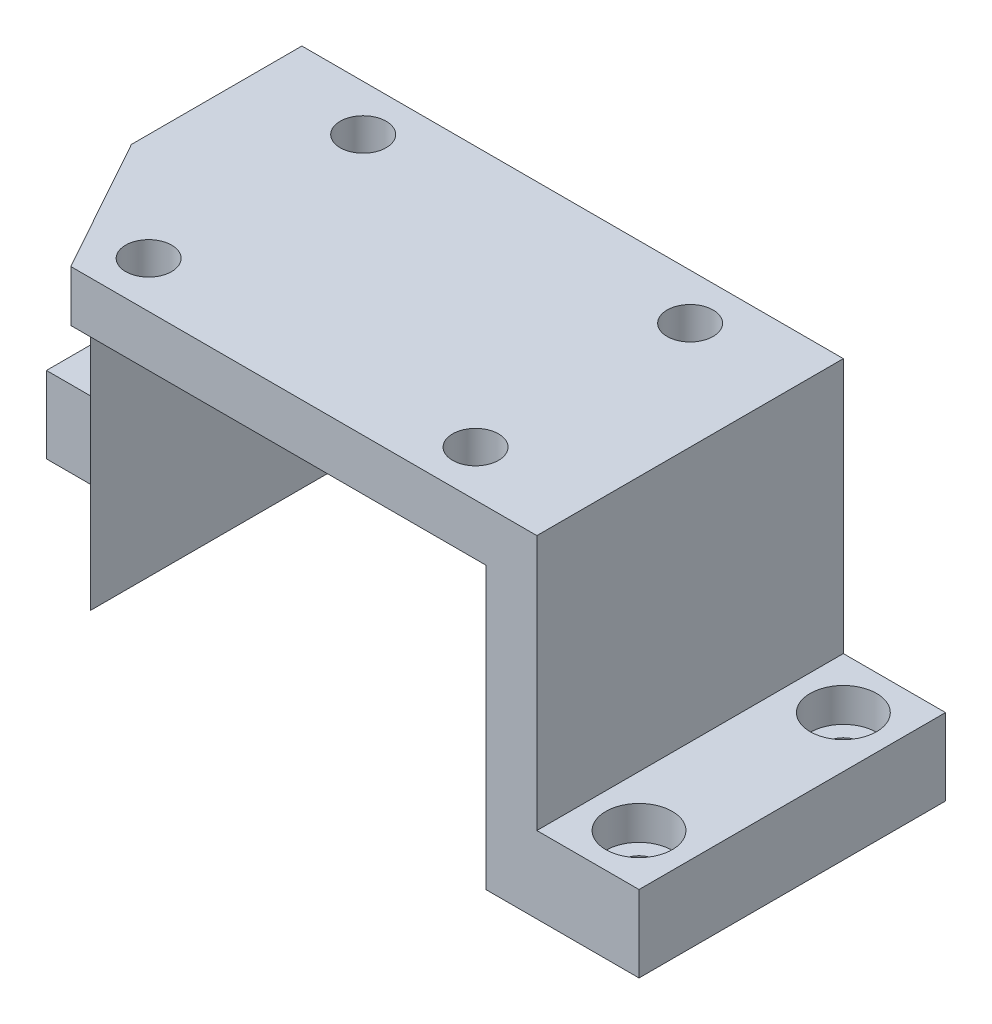
ISO-10303-21;
HEADER;
FILE_DESCRIPTION(('STEP AP214'),'2;1');
FILE_NAME('part.step','',(''),(''),'','','');
FILE_SCHEMA(('AUTOMOTIVE_DESIGN { 1 0 10303 214 1 1 1 1 }'));
ENDSEC;
DATA;
#1=APPLICATION_CONTEXT('core data for automotive mechanical design processes');
#2=APPLICATION_PROTOCOL_DEFINITION('international standard','automotive_design',2000,#1);
#3=PRODUCT_CONTEXT('',#1,'mechanical');
#4=PRODUCT('Part','Part','',(#3));
#5=PRODUCT_RELATED_PRODUCT_CATEGORY('part','',(#4));
#6=PRODUCT_DEFINITION_FORMATION('','',#4);
#7=PRODUCT_DEFINITION_CONTEXT('part definition',#1,'design');
#8=PRODUCT_DEFINITION('design','',#6,#7);
#9=PRODUCT_DEFINITION_SHAPE('','',#8);
#10=(LENGTH_UNIT() NAMED_UNIT(*) SI_UNIT(.MILLI.,.METRE.));
#11=(NAMED_UNIT(*) PLANE_ANGLE_UNIT() SI_UNIT($,.RADIAN.));
#12=(NAMED_UNIT(*) SI_UNIT($,.STERADIAN.) SOLID_ANGLE_UNIT());
#13=UNCERTAINTY_MEASURE_WITH_UNIT(LENGTH_MEASURE(1.E-05),#10,'distance_accuracy_value','');
#14=(GEOMETRIC_REPRESENTATION_CONTEXT(3) GLOBAL_UNCERTAINTY_ASSIGNED_CONTEXT((#13)) GLOBAL_UNIT_ASSIGNED_CONTEXT((#10,
#11,#12)) REPRESENTATION_CONTEXT('',''));
#15=CARTESIAN_POINT('',(0.,0.,0.));
#16=DIRECTION('',(0.,0.,1.));
#17=DIRECTION('',(1.,0.,0.));
#18=AXIS2_PLACEMENT_3D('',#15,#16,#17);
#19=CARTESIAN_POINT('',(-53.,10.,30.));
#20=DIRECTION('',(1.,0.,0.));
#21=DIRECTION('',(0.,0.,-1.));
#22=AXIS2_PLACEMENT_3D('',#19,#20,#21);
#23=PLANE('',#22);
#24=DIRECTION('',(0.,0.,-1.));
#25=VECTOR('',#24,1.);
#26=CARTESIAN_POINT('',(-53.,-55.,30.));
#27=LINE('',#26,#25);
#28=CARTESIAN_POINT('',(-53.,-55.,3.37045108443876));
#29=VERTEX_POINT('',#28);
#30=CARTESIAN_POINT('',(-53.,-55.,0.));
#31=VERTEX_POINT('',#30);
#32=EDGE_CURVE('E55',#29,#31,#27,.T.);
#33=ORIENTED_EDGE('',*,*,#32,.F.);
#34=DIRECTION('',(0.,1.,0.));
#35=VECTOR('',#34,1.);
#36=CARTESIAN_POINT('',(-53.,-55.,3.37045108443878));
#37=LINE('',#36,#35);
#38=CARTESIAN_POINT('',(-53.,10.,3.37045108443878));
#39=VERTEX_POINT('',#38);
#40=EDGE_CURVE('E48',#29,#39,#37,.T.);
#41=ORIENTED_EDGE('',*,*,#40,.T.);
#42=DIRECTION('',(0.,0.,1.));
#43=VECTOR('',#42,1.);
#44=CARTESIAN_POINT('',(-53.,10.,30.));
#45=LINE('',#44,#43);
#46=CARTESIAN_POINT('',(-53.,10.,-30.));
#47=VERTEX_POINT('',#46);
#48=EDGE_CURVE('E150',#47,#39,#45,.T.);
#49=ORIENTED_EDGE('',*,*,#48,.F.);
#50=DIRECTION('',(0.,-1.,0.));
#51=VECTOR('',#50,1.);
#52=CARTESIAN_POINT('',(-53.,10.,-30.));
#53=LINE('',#52,#51);
#54=CARTESIAN_POINT('',(-53.,-40.,-30.));
#55=VERTEX_POINT('',#54);
#56=EDGE_CURVE('E157',#47,#55,#53,.T.);
#57=ORIENTED_EDGE('',*,*,#56,.T.);
#58=DIRECTION('',(0.,0.,-1.));
#59=VECTOR('',#58,1.);
#60=CARTESIAN_POINT('',(-53.,-40.,-30.));
#61=LINE('',#60,#59);
#62=CARTESIAN_POINT('',(-53.,-40.,0.));
#63=VERTEX_POINT('',#62);
#64=EDGE_CURVE('E293',#63,#55,#61,.T.);
#65=ORIENTED_EDGE('',*,*,#64,.F.);
#66=DIRECTION('',(0.,1.,0.));
#67=VECTOR('',#66,1.);
#68=CARTESIAN_POINT('',(-53.,-40.,0.));
#69=LINE('',#68,#67);
#70=EDGE_CURVE('E288',#31,#63,#69,.T.);
#71=ORIENTED_EDGE('',*,*,#70,.F.);
#72=EDGE_LOOP('',(#33,#41,#49,#57,#65,#71));
#73=FACE_BOUND('',#72,.T.);
#74=ADVANCED_FACE('F34',(#73),#23,.F.);
#75=CARTESIAN_POINT('',(53.,10.,30.));
#76=DIRECTION('',(-1.,0.,0.));
#77=DIRECTION('',(0.,0.,1.));
#78=AXIS2_PLACEMENT_3D('',#75,#76,#77);
#79=PLANE('',#78);
#80=DIRECTION('',(0.,0.,1.));
#81=VECTOR('',#80,1.);
#82=CARTESIAN_POINT('',(53.,-40.,30.));
#83=LINE('',#82,#81);
#84=CARTESIAN_POINT('',(53.,-40.,-30.));
#85=VERTEX_POINT('',#84);
#86=CARTESIAN_POINT('',(53.,-40.,30.));
#87=VERTEX_POINT('',#86);
#88=EDGE_CURVE('E184',#85,#87,#83,.T.);
#89=ORIENTED_EDGE('',*,*,#88,.F.);
#90=DIRECTION('',(0.,-1.,0.));
#91=VECTOR('',#90,1.);
#92=CARTESIAN_POINT('',(53.,10.,-30.));
#93=LINE('',#92,#91);
#94=CARTESIAN_POINT('',(53.,10.,-30.));
#95=VERTEX_POINT('',#94);
#96=EDGE_CURVE('E42',#95,#85,#93,.T.);
#97=ORIENTED_EDGE('',*,*,#96,.F.);
#98=DIRECTION('',(0.,0.,-1.));
#99=VECTOR('',#98,1.);
#100=CARTESIAN_POINT('',(53.,10.,30.));
#101=LINE('',#100,#99);
#102=CARTESIAN_POINT('',(53.,10.,30.));
#103=VERTEX_POINT('',#102);
#104=EDGE_CURVE('E167',#103,#95,#101,.T.);
#105=ORIENTED_EDGE('',*,*,#104,.F.);
#106=DIRECTION('',(0.,-1.,0.));
#107=VECTOR('',#106,1.);
#108=CARTESIAN_POINT('',(53.,10.,30.));
#109=LINE('',#108,#107);
#110=EDGE_CURVE('E154',#103,#87,#109,.T.);
#111=ORIENTED_EDGE('',*,*,#110,.T.);
#112=EDGE_LOOP('',(#89,#97,#105,#111));
#113=FACE_BOUND('',#112,.T.);
#114=ADVANCED_FACE('F36',(#113),#79,.F.);
#115=CARTESIAN_POINT('',(0.,0.,0.));
#116=DIRECTION('',(0.,-1.,0.));
#117=DIRECTION('',(0.,0.,-1.));
#118=AXIS2_PLACEMENT_3D('',#115,#116,#117);
#119=PLANE('',#118);
#120=DIRECTION('',(0.484809620246341,0.,0.874619707139394));
#121=VECTOR('',#120,1.);
#122=CARTESIAN_POINT('',(-41.9720128148531,0.,23.2654666109649));
#123=LINE('',#122,#121);
#124=CARTESIAN_POINT('',(-43.,0.,21.4109286371528));
#125=VERTEX_POINT('',#124);
#126=CARTESIAN_POINT('',(-38.239,0.,30.));
#127=VERTEX_POINT('',#126);
#128=EDGE_CURVE('E138',#125,#127,#123,.T.);
#129=ORIENTED_EDGE('',*,*,#128,.F.);
#130=DIRECTION('',(0.,0.,1.));
#131=VECTOR('',#130,1.);
#132=CARTESIAN_POINT('',(-43.,0.,30.));
#133=LINE('',#132,#131);
#134=CARTESIAN_POINT('',(-43.,0.,-30.));
#135=VERTEX_POINT('',#134);
#136=EDGE_CURVE('E205',#135,#125,#133,.T.);
#137=ORIENTED_EDGE('',*,*,#136,.F.);
#138=DIRECTION('',(-1.,0.,0.));
#139=VECTOR('',#138,1.);
#140=CARTESIAN_POINT('',(-53.,0.,-30.));
#141=LINE('',#140,#139);
#142=CARTESIAN_POINT('',(43.,0.,-30.));
#143=VERTEX_POINT('',#142);
#144=EDGE_CURVE('E163',#143,#135,#141,.T.);
#145=ORIENTED_EDGE('',*,*,#144,.F.);
#146=DIRECTION('',(0.,0.,-1.));
#147=VECTOR('',#146,1.);
#148=CARTESIAN_POINT('',(43.,0.,30.));
#149=LINE('',#148,#147);
#150=CARTESIAN_POINT('',(43.,0.,30.));
#151=VERTEX_POINT('',#150);
#152=EDGE_CURVE('E186',#151,#143,#149,.T.);
#153=ORIENTED_EDGE('',*,*,#152,.F.);
#154=DIRECTION('',(1.,0.,0.));
#155=VECTOR('',#154,1.);
#156=CARTESIAN_POINT('',(-53.,0.,30.));
#157=LINE('',#156,#155);
#158=EDGE_CURVE('E165',#127,#151,#157,.T.);
#159=ORIENTED_EDGE('',*,*,#158,.F.);
#160=EDGE_LOOP('',(#129,#137,#145,#153,#159));
#161=FACE_BOUND('',#160,.T.);
#162=CARTESIAN_POINT('',(-32.,0.,21.));
#163=DIRECTION('',(0.,-1.,0.));
#164=DIRECTION('',(0.,0.,-1.));
#165=AXIS2_PLACEMENT_3D('',#162,#163,#164);
#166=CIRCLE('',#165,4.5);
#167=CARTESIAN_POINT('',(-32.,0.,16.5));
#168=VERTEX_POINT('',#167);
#169=EDGE_CURVE('E285',#168,#168,#166,.T.);
#170=ORIENTED_EDGE('',*,*,#169,.F.);
#171=EDGE_LOOP('',(#170));
#172=FACE_BOUND('',#171,.T.);
#173=CARTESIAN_POINT('',(32.,0.,21.));
#174=DIRECTION('',(0.,-1.,0.));
#175=DIRECTION('',(0.,0.,-1.));
#176=AXIS2_PLACEMENT_3D('',#173,#174,#175);
#177=CIRCLE('',#176,4.5);
#178=CARTESIAN_POINT('',(32.,0.,16.5));
#179=VERTEX_POINT('',#178);
#180=EDGE_CURVE('E282',#179,#179,#177,.T.);
#181=ORIENTED_EDGE('',*,*,#180,.F.);
#182=EDGE_LOOP('',(#181));
#183=FACE_BOUND('',#182,.T.);
#184=CARTESIAN_POINT('',(32.,0.,-21.));
#185=DIRECTION('',(0.,-1.,0.));
#186=DIRECTION('',(0.,0.,-1.));
#187=AXIS2_PLACEMENT_3D('',#184,#185,#186);
#188=CIRCLE('',#187,4.5);
#189=CARTESIAN_POINT('',(32.,0.,-25.5));
#190=VERTEX_POINT('',#189);
#191=EDGE_CURVE('E279',#190,#190,#188,.T.);
#192=ORIENTED_EDGE('',*,*,#191,.F.);
#193=EDGE_LOOP('',(#192));
#194=FACE_BOUND('',#193,.T.);
#195=CARTESIAN_POINT('',(-32.,0.,-21.));
#196=DIRECTION('',(0.,-1.,0.));
#197=DIRECTION('',(0.,0.,-1.));
#198=AXIS2_PLACEMENT_3D('',#195,#196,#197);
#199=CIRCLE('',#198,4.5);
#200=CARTESIAN_POINT('',(-32.,0.,-25.5));
#201=VERTEX_POINT('',#200);
#202=EDGE_CURVE('E276',#201,#201,#199,.T.);
#203=ORIENTED_EDGE('',*,*,#202,.F.);
#204=EDGE_LOOP('',(#203));
#205=FACE_BOUND('',#204,.T.);
#206=ADVANCED_FACE('F334',(#161,#172,#183,#194,#205),#119,.T.);
#207=CARTESIAN_POINT('',(-53.,10.,-30.));
#208=DIRECTION('',(0.,0.,1.));
#209=DIRECTION('',(1.,0.,0.));
#210=AXIS2_PLACEMENT_3D('',#207,#208,#209);
#211=PLANE('',#210);
#212=ORIENTED_EDGE('',*,*,#96,.T.);
#213=DIRECTION('',(-1.,0.,0.));
#214=VECTOR('',#213,1.);
#215=CARTESIAN_POINT('',(73.,-40.,-30.));
#216=LINE('',#215,#214);
#217=CARTESIAN_POINT('',(73.,-40.,-30.));
#218=VERTEX_POINT('',#217);
#219=EDGE_CURVE('E176',#218,#85,#216,.T.);
#220=ORIENTED_EDGE('',*,*,#219,.F.);
#221=DIRECTION('',(0.,1.,0.));
#222=VECTOR('',#221,1.);
#223=CARTESIAN_POINT('',(73.,-55.,-30.));
#224=LINE('',#223,#222);
#225=CARTESIAN_POINT('',(73.,-55.,-30.));
#226=VERTEX_POINT('',#225);
#227=EDGE_CURVE('E315',#226,#218,#224,.T.);
#228=ORIENTED_EDGE('',*,*,#227,.F.);
#229=DIRECTION('',(1.,0.,0.));
#230=VECTOR('',#229,1.);
#231=CARTESIAN_POINT('',(53.,-55.,-30.));
#232=LINE('',#231,#230);
#233=CARTESIAN_POINT('',(43.,-55.,-30.));
#234=VERTEX_POINT('',#233);
#235=EDGE_CURVE('E198',#234,#226,#232,.T.);
#236=ORIENTED_EDGE('',*,*,#235,.F.);
#237=DIRECTION('',(0.,1.,0.));
#238=VECTOR('',#237,1.);
#239=CARTESIAN_POINT('',(43.,-55.,-30.));
#240=LINE('',#239,#238);
#241=EDGE_CURVE('E199',#234,#143,#240,.T.);
#242=ORIENTED_EDGE('',*,*,#241,.T.);
#243=ORIENTED_EDGE('',*,*,#144,.T.);
#244=DIRECTION('',(0.,1.,0.));
#245=VECTOR('',#244,1.);
#246=CARTESIAN_POINT('',(-43.,-55.,-30.));
#247=LINE('',#246,#245);
#248=CARTESIAN_POINT('',(-43.,-55.,-30.));
#249=VERTEX_POINT('',#248);
#250=EDGE_CURVE('E166',#249,#135,#247,.T.);
#251=ORIENTED_EDGE('',*,*,#250,.F.);
#252=DIRECTION('',(1.,0.,0.));
#253=VECTOR('',#252,1.);
#254=CARTESIAN_POINT('',(-53.,-55.,-30.));
#255=LINE('',#254,#253);
#256=CARTESIAN_POINT('',(-73.,-55.,-30.));
#257=VERTEX_POINT('',#256);
#258=EDGE_CURVE('E207',#257,#249,#255,.T.);
#259=ORIENTED_EDGE('',*,*,#258,.F.);
#260=DIRECTION('',(0.,-1.,0.));
#261=VECTOR('',#260,1.);
#262=CARTESIAN_POINT('',(-73.,-55.,-30.));
#263=LINE('',#262,#261);
#264=CARTESIAN_POINT('',(-73.,-40.,-30.));
#265=VERTEX_POINT('',#264);
#266=EDGE_CURVE('E289',#265,#257,#263,.T.);
#267=ORIENTED_EDGE('',*,*,#266,.F.);
#268=DIRECTION('',(1.,0.,0.));
#269=VECTOR('',#268,1.);
#270=CARTESIAN_POINT('',(-73.,-40.,-30.));
#271=LINE('',#270,#269);
#272=EDGE_CURVE('E219',#265,#55,#271,.T.);
#273=ORIENTED_EDGE('',*,*,#272,.T.);
#274=ORIENTED_EDGE('',*,*,#56,.F.);
#275=DIRECTION('',(-1.,0.,0.));
#276=VECTOR('',#275,1.);
#277=CARTESIAN_POINT('',(-53.,10.,-30.));
#278=LINE('',#277,#276);
#279=EDGE_CURVE('E159',#95,#47,#278,.T.);
#280=ORIENTED_EDGE('',*,*,#279,.F.);
#281=EDGE_LOOP('',(#212,#220,#228,#236,#242,#243,#251,#259,#267,#273,#274,#280));
#282=FACE_BOUND('',#281,.T.);
#283=ADVANCED_FACE('F174',(#282),#211,.F.);
#284=CARTESIAN_POINT('',(-53.,10.,30.));
#285=DIRECTION('',(0.,0.,-1.));
#286=DIRECTION('',(-1.,0.,0.));
#287=AXIS2_PLACEMENT_3D('',#284,#285,#286);
#288=PLANE('',#287);
#289=DIRECTION('',(1.,0.,0.));
#290=VECTOR('',#289,1.);
#291=CARTESIAN_POINT('',(-53.,10.,30.));
#292=LINE('',#291,#290);
#293=CARTESIAN_POINT('',(-38.239,10.,30.));
#294=VERTEX_POINT('',#293);
#295=EDGE_CURVE('E147',#294,#103,#292,.T.);
#296=ORIENTED_EDGE('',*,*,#295,.F.);
#297=DIRECTION('',(0.,1.,0.));
#298=VECTOR('',#297,1.);
#299=CARTESIAN_POINT('',(-38.239,-55.,30.));
#300=LINE('',#299,#298);
#301=EDGE_CURVE('E133',#127,#294,#300,.T.);
#302=ORIENTED_EDGE('',*,*,#301,.F.);
#303=ORIENTED_EDGE('',*,*,#158,.T.);
#304=DIRECTION('',(0.,1.,0.));
#305=VECTOR('',#304,1.);
#306=CARTESIAN_POINT('',(43.,-55.,30.));
#307=LINE('',#306,#305);
#308=CARTESIAN_POINT('',(43.,-55.,30.));
#309=VERTEX_POINT('',#308);
#310=EDGE_CURVE('E202',#309,#151,#307,.T.);
#311=ORIENTED_EDGE('',*,*,#310,.F.);
#312=DIRECTION('',(-1.,0.,0.));
#313=VECTOR('',#312,1.);
#314=CARTESIAN_POINT('',(53.,-55.,30.));
#315=LINE('',#314,#313);
#316=CARTESIAN_POINT('',(73.,-55.,30.));
#317=VERTEX_POINT('',#316);
#318=EDGE_CURVE('E190',#317,#309,#315,.T.);
#319=ORIENTED_EDGE('',*,*,#318,.F.);
#320=DIRECTION('',(0.,-1.,0.));
#321=VECTOR('',#320,1.);
#322=CARTESIAN_POINT('',(73.,-55.,30.));
#323=LINE('',#322,#321);
#324=CARTESIAN_POINT('',(73.,-40.,30.));
#325=VERTEX_POINT('',#324);
#326=EDGE_CURVE('E309',#325,#317,#323,.T.);
#327=ORIENTED_EDGE('',*,*,#326,.F.);
#328=DIRECTION('',(-1.,0.,0.));
#329=VECTOR('',#328,1.);
#330=CARTESIAN_POINT('',(73.,-40.,30.));
#331=LINE('',#330,#329);
#332=EDGE_CURVE('E187',#325,#87,#331,.T.);
#333=ORIENTED_EDGE('',*,*,#332,.T.);
#334=ORIENTED_EDGE('',*,*,#110,.F.);
#335=EDGE_LOOP('',(#296,#302,#303,#311,#319,#327,#333,#334));
#336=FACE_BOUND('',#335,.T.);
#337=ADVANCED_FACE('F152',(#336),#288,.F.);
#338=CARTESIAN_POINT('',(0.,10.,0.));
#339=DIRECTION('',(0.,-1.,0.));
#340=DIRECTION('',(0.,0.,-1.));
#341=AXIS2_PLACEMENT_3D('',#338,#339,#340);
#342=PLANE('',#341);
#343=CARTESIAN_POINT('',(-32.,10.,21.));
#344=DIRECTION('',(0.,1.,0.));
#345=DIRECTION('',(0.,0.,-1.));
#346=AXIS2_PLACEMENT_3D('',#343,#344,#345);
#347=CIRCLE('',#346,4.5);
#348=CARTESIAN_POINT('',(-32.,10.,16.5));
#349=VERTEX_POINT('',#348);
#350=EDGE_CURVE('E262',#349,#349,#347,.T.);
#351=ORIENTED_EDGE('',*,*,#350,.F.);
#352=EDGE_LOOP('',(#351));
#353=FACE_BOUND('',#352,.T.);
#354=CARTESIAN_POINT('',(32.,10.,21.));
#355=DIRECTION('',(0.,1.,0.));
#356=DIRECTION('',(0.,0.,1.));
#357=AXIS2_PLACEMENT_3D('',#354,#355,#356);
#358=CIRCLE('',#357,4.5);
#359=CARTESIAN_POINT('',(32.,10.,25.5));
#360=VERTEX_POINT('',#359);
#361=EDGE_CURVE('E269',#360,#360,#358,.T.);
#362=ORIENTED_EDGE('',*,*,#361,.F.);
#363=EDGE_LOOP('',(#362));
#364=FACE_BOUND('',#363,.T.);
#365=CARTESIAN_POINT('',(32.,10.,-21.));
#366=DIRECTION('',(0.,1.,0.));
#367=DIRECTION('',(0.,0.,-1.));
#368=AXIS2_PLACEMENT_3D('',#365,#366,#367);
#369=CIRCLE('',#368,4.5);
#370=CARTESIAN_POINT('',(32.,10.,-25.5));
#371=VERTEX_POINT('',#370);
#372=EDGE_CURVE('E265',#371,#371,#369,.T.);
#373=ORIENTED_EDGE('',*,*,#372,.F.);
#374=EDGE_LOOP('',(#373));
#375=FACE_BOUND('',#374,.T.);
#376=CARTESIAN_POINT('',(-32.,10.,-21.));
#377=DIRECTION('',(0.,1.,0.));
#378=DIRECTION('',(0.,0.,1.));
#379=AXIS2_PLACEMENT_3D('',#376,#377,#378);
#380=CIRCLE('',#379,4.5);
#381=CARTESIAN_POINT('',(-32.,10.,-16.5));
#382=VERTEX_POINT('',#381);
#383=EDGE_CURVE('E268',#382,#382,#380,.T.);
#384=ORIENTED_EDGE('',*,*,#383,.F.);
#385=EDGE_LOOP('',(#384));
#386=FACE_BOUND('',#385,.T.);
#387=ORIENTED_EDGE('',*,*,#48,.T.);
#388=DIRECTION('',(-0.484809620246341,0.,-0.874619707139394));
#389=VECTOR('',#388,1.);
#390=CARTESIAN_POINT('',(-38.239,10.,30.));
#391=LINE('',#390,#389);
#392=EDGE_CURVE('E136',#294,#39,#391,.T.);
#393=ORIENTED_EDGE('',*,*,#392,.F.);
#394=ORIENTED_EDGE('',*,*,#295,.T.);
#395=ORIENTED_EDGE('',*,*,#104,.T.);
#396=ORIENTED_EDGE('',*,*,#279,.T.);
#397=EDGE_LOOP('',(#387,#393,#394,#395,#396));
#398=FACE_BOUND('',#397,.T.);
#399=ADVANCED_FACE('F145',(#353,#364,#375,#386,#398),#342,.F.);
#400=CARTESIAN_POINT('',(-43.,-55.,30.));
#401=DIRECTION('',(-1.,0.,0.));
#402=DIRECTION('',(0.,0.,1.));
#403=AXIS2_PLACEMENT_3D('',#400,#401,#402);
#404=PLANE('',#403);
#405=ORIENTED_EDGE('',*,*,#136,.T.);
#406=DIRECTION('',(0.,-1.,0.));
#407=VECTOR('',#406,1.);
#408=CARTESIAN_POINT('',(-43.,-55.,21.4109286371528));
#409=LINE('',#408,#407);
#410=CARTESIAN_POINT('',(-43.,-55.,21.4109286371528));
#411=VERTEX_POINT('',#410);
#412=EDGE_CURVE('E222',#125,#411,#409,.T.);
#413=ORIENTED_EDGE('',*,*,#412,.T.);
#414=DIRECTION('',(0.,0.,1.));
#415=VECTOR('',#414,1.);
#416=CARTESIAN_POINT('',(-43.,-55.,30.));
#417=LINE('',#416,#415);
#418=EDGE_CURVE('E209',#249,#411,#417,.T.);
#419=ORIENTED_EDGE('',*,*,#418,.F.);
#420=ORIENTED_EDGE('',*,*,#250,.T.);
#421=EDGE_LOOP('',(#405,#413,#419,#420));
#422=FACE_BOUND('',#421,.T.);
#423=ADVANCED_FACE('F338',(#422),#404,.F.);
#424=CARTESIAN_POINT('',(0.,-55.,0.));
#425=DIRECTION('',(0.,-1.,0.));
#426=DIRECTION('',(0.,0.,-1.));
#427=AXIS2_PLACEMENT_3D('',#424,#425,#426);
#428=PLANE('',#427);
#429=DIRECTION('',(0.484809620246341,0.,0.874619707139394));
#430=VECTOR('',#429,1.);
#431=CARTESIAN_POINT('',(-41.9720128148531,-55.,23.2654666109649));
#432=LINE('',#431,#430);
#433=EDGE_CURVE('E11',#29,#411,#432,.T.);
#434=ORIENTED_EDGE('',*,*,#433,.F.);
#435=ORIENTED_EDGE('',*,*,#32,.T.);
#436=DIRECTION('',(1.,0.,0.));
#437=VECTOR('',#436,1.);
#438=CARTESIAN_POINT('',(-73.,-55.,0.));
#439=LINE('',#438,#437);
#440=CARTESIAN_POINT('',(-73.,-55.,0.));
#441=VERTEX_POINT('',#440);
#442=EDGE_CURVE('E306',#441,#31,#439,.T.);
#443=ORIENTED_EDGE('',*,*,#442,.F.);
#444=DIRECTION('',(0.,0.,1.));
#445=VECTOR('',#444,1.);
#446=CARTESIAN_POINT('',(-73.,-55.,-30.));
#447=LINE('',#446,#445);
#448=EDGE_CURVE('E292',#257,#441,#447,.T.);
#449=ORIENTED_EDGE('',*,*,#448,.F.);
#450=ORIENTED_EDGE('',*,*,#258,.T.);
#451=ORIENTED_EDGE('',*,*,#418,.T.);
#452=EDGE_LOOP('',(#434,#435,#443,#449,#450,#451));
#453=FACE_BOUND('',#452,.T.);
#454=CARTESIAN_POINT('',(-63.,-55.,-20.));
#455=DIRECTION('',(0.,1.,0.));
#456=DIRECTION('',(0.,0.,1.));
#457=AXIS2_PLACEMENT_3D('',#454,#455,#456);
#458=CIRCLE('',#457,3.3);
#459=CARTESIAN_POINT('',(-63.,-55.,-16.7));
#460=VERTEX_POINT('',#459);
#461=EDGE_CURVE('E229',#460,#460,#458,.T.);
#462=ORIENTED_EDGE('',*,*,#461,.T.);
#463=EDGE_LOOP('',(#462));
#464=FACE_BOUND('',#463,.T.);
#465=ADVANCED_FACE('F340',(#453,#464),#428,.T.);
#466=CARTESIAN_POINT('',(43.,-55.,30.));
#467=DIRECTION('',(1.,0.,0.));
#468=DIRECTION('',(0.,0.,-1.));
#469=AXIS2_PLACEMENT_3D('',#466,#467,#468);
#470=PLANE('',#469);
#471=ORIENTED_EDGE('',*,*,#152,.T.);
#472=ORIENTED_EDGE('',*,*,#241,.F.);
#473=DIRECTION('',(0.,0.,-1.));
#474=VECTOR('',#473,1.);
#475=CARTESIAN_POINT('',(43.,-55.,30.));
#476=LINE('',#475,#474);
#477=EDGE_CURVE('E196',#309,#234,#476,.T.);
#478=ORIENTED_EDGE('',*,*,#477,.F.);
#479=ORIENTED_EDGE('',*,*,#310,.T.);
#480=EDGE_LOOP('',(#471,#472,#478,#479));
#481=FACE_BOUND('',#480,.T.);
#482=ADVANCED_FACE('F332',(#481),#470,.F.);
#483=CARTESIAN_POINT('',(0.,-55.,0.));
#484=DIRECTION('',(0.,1.,0.));
#485=DIRECTION('',(0.,0.,1.));
#486=AXIS2_PLACEMENT_3D('',#483,#484,#485);
#487=PLANE('',#486);
#488=CARTESIAN_POINT('',(63.,-55.,20.));
#489=DIRECTION('',(0.,1.,0.));
#490=DIRECTION('',(0.,0.,1.));
#491=AXIS2_PLACEMENT_3D('',#488,#489,#490);
#492=CIRCLE('',#491,3.29999999999999);
#493=CARTESIAN_POINT('',(63.,-55.,23.3));
#494=VERTEX_POINT('',#493);
#495=EDGE_CURVE('E236',#494,#494,#492,.T.);
#496=ORIENTED_EDGE('',*,*,#495,.T.);
#497=EDGE_LOOP('',(#496));
#498=FACE_BOUND('',#497,.T.);
#499=CARTESIAN_POINT('',(63.,-55.,-20.));
#500=DIRECTION('',(0.,1.,0.));
#501=DIRECTION('',(0.,0.,1.));
#502=AXIS2_PLACEMENT_3D('',#499,#500,#501);
#503=CIRCLE('',#502,3.29999999999999);
#504=CARTESIAN_POINT('',(63.,-55.,-16.7));
#505=VERTEX_POINT('',#504);
#506=EDGE_CURVE('E242',#505,#505,#503,.T.);
#507=ORIENTED_EDGE('',*,*,#506,.T.);
#508=EDGE_LOOP('',(#507));
#509=FACE_BOUND('',#508,.T.);
#510=ORIENTED_EDGE('',*,*,#235,.T.);
#511=DIRECTION('',(0.,0.,-1.));
#512=VECTOR('',#511,1.);
#513=CARTESIAN_POINT('',(73.,-55.,30.));
#514=LINE('',#513,#512);
#515=EDGE_CURVE('E312',#317,#226,#514,.T.);
#516=ORIENTED_EDGE('',*,*,#515,.F.);
#517=ORIENTED_EDGE('',*,*,#318,.T.);
#518=ORIENTED_EDGE('',*,*,#477,.T.);
#519=EDGE_LOOP('',(#510,#516,#517,#518));
#520=FACE_BOUND('',#519,.T.);
#521=ADVANCED_FACE('F324',(#498,#509,#520),#487,.F.);
#522=CARTESIAN_POINT('',(73.,-40.,30.));
#523=DIRECTION('',(0.,-1.,0.));
#524=DIRECTION('',(0.,0.,-1.));
#525=AXIS2_PLACEMENT_3D('',#522,#523,#524);
#526=PLANE('',#525);
#527=CARTESIAN_POINT('',(63.,-40.,20.));
#528=DIRECTION('',(0.,1.,0.));
#529=DIRECTION('',(0.,0.,1.));
#530=AXIS2_PLACEMENT_3D('',#527,#528,#529);
#531=CIRCLE('',#530,6.5);
#532=CARTESIAN_POINT('',(63.,-40.,26.5));
#533=VERTEX_POINT('',#532);
#534=EDGE_CURVE('E251',#533,#533,#531,.T.);
#535=ORIENTED_EDGE('',*,*,#534,.F.);
#536=EDGE_LOOP('',(#535));
#537=FACE_BOUND('',#536,.T.);
#538=CARTESIAN_POINT('',(63.,-40.,-20.));
#539=DIRECTION('',(0.,1.,0.));
#540=DIRECTION('',(0.,0.,1.));
#541=AXIS2_PLACEMENT_3D('',#538,#539,#540);
#542=CIRCLE('',#541,6.5);
#543=CARTESIAN_POINT('',(63.,-40.,-13.5));
#544=VERTEX_POINT('',#543);
#545=EDGE_CURVE('E250',#544,#544,#542,.T.);
#546=ORIENTED_EDGE('',*,*,#545,.F.);
#547=EDGE_LOOP('',(#546));
#548=FACE_BOUND('',#547,.T.);
#549=ORIENTED_EDGE('',*,*,#88,.T.);
#550=ORIENTED_EDGE('',*,*,#332,.F.);
#551=DIRECTION('',(0.,0.,1.));
#552=VECTOR('',#551,1.);
#553=CARTESIAN_POINT('',(73.,-40.,30.));
#554=LINE('',#553,#552);
#555=EDGE_CURVE('E185',#218,#325,#554,.T.);
#556=ORIENTED_EDGE('',*,*,#555,.F.);
#557=ORIENTED_EDGE('',*,*,#219,.T.);
#558=EDGE_LOOP('',(#549,#550,#556,#557));
#559=FACE_BOUND('',#558,.T.);
#560=ADVANCED_FACE('F182',(#537,#548,#559),#526,.F.);
#561=CARTESIAN_POINT('',(73.,0.,0.));
#562=DIRECTION('',(-1.,0.,0.));
#563=DIRECTION('',(0.,0.,1.));
#564=AXIS2_PLACEMENT_3D('',#561,#562,#563);
#565=PLANE('',#564);
#566=ORIENTED_EDGE('',*,*,#326,.T.);
#567=ORIENTED_EDGE('',*,*,#515,.T.);
#568=ORIENTED_EDGE('',*,*,#227,.T.);
#569=ORIENTED_EDGE('',*,*,#555,.T.);
#570=EDGE_LOOP('',(#566,#567,#568,#569));
#571=FACE_BOUND('',#570,.T.);
#572=ADVANCED_FACE('F318',(#571),#565,.F.);
#573=CARTESIAN_POINT('',(-73.,-40.,0.));
#574=DIRECTION('',(0.,0.,-1.));
#575=DIRECTION('',(-1.,0.,0.));
#576=AXIS2_PLACEMENT_3D('',#573,#574,#575);
#577=PLANE('',#576);
#578=ORIENTED_EDGE('',*,*,#70,.T.);
#579=DIRECTION('',(1.,0.,0.));
#580=VECTOR('',#579,1.);
#581=CARTESIAN_POINT('',(-73.,-40.,0.));
#582=LINE('',#581,#580);
#583=CARTESIAN_POINT('',(-73.,-40.,0.));
#584=VERTEX_POINT('',#583);
#585=EDGE_CURVE('E303',#584,#63,#582,.T.);
#586=ORIENTED_EDGE('',*,*,#585,.F.);
#587=DIRECTION('',(0.,1.,0.));
#588=VECTOR('',#587,1.);
#589=CARTESIAN_POINT('',(-73.,-40.,0.));
#590=LINE('',#589,#588);
#591=EDGE_CURVE('E295',#441,#584,#590,.T.);
#592=ORIENTED_EDGE('',*,*,#591,.F.);
#593=ORIENTED_EDGE('',*,*,#442,.T.);
#594=EDGE_LOOP('',(#578,#586,#592,#593));
#595=FACE_BOUND('',#594,.T.);
#596=ADVANCED_FACE('F350',(#595),#577,.F.);
#597=CARTESIAN_POINT('',(-73.,-40.,-30.));
#598=DIRECTION('',(0.,-1.,0.));
#599=DIRECTION('',(0.,0.,-1.));
#600=AXIS2_PLACEMENT_3D('',#597,#598,#599);
#601=PLANE('',#600);
#602=CARTESIAN_POINT('',(-63.,-40.,-20.));
#603=DIRECTION('',(0.,1.,0.));
#604=DIRECTION('',(0.,0.,1.));
#605=AXIS2_PLACEMENT_3D('',#602,#603,#604);
#606=CIRCLE('',#605,6.5);
#607=CARTESIAN_POINT('',(-63.,-40.,-13.5));
#608=VERTEX_POINT('',#607);
#609=EDGE_CURVE('E232',#608,#608,#606,.T.);
#610=ORIENTED_EDGE('',*,*,#609,.F.);
#611=EDGE_LOOP('',(#610));
#612=FACE_BOUND('',#611,.T.);
#613=ORIENTED_EDGE('',*,*,#64,.T.);
#614=ORIENTED_EDGE('',*,*,#272,.F.);
#615=DIRECTION('',(0.,0.,-1.));
#616=VECTOR('',#615,1.);
#617=CARTESIAN_POINT('',(-73.,-40.,-30.));
#618=LINE('',#617,#616);
#619=EDGE_CURVE('E297',#584,#265,#618,.T.);
#620=ORIENTED_EDGE('',*,*,#619,.F.);
#621=ORIENTED_EDGE('',*,*,#585,.T.);
#622=EDGE_LOOP('',(#613,#614,#620,#621));
#623=FACE_BOUND('',#622,.T.);
#624=ADVANCED_FACE('F348',(#612,#623),#601,.F.);
#625=CARTESIAN_POINT('',(-73.,0.,0.));
#626=DIRECTION('',(1.,0.,0.));
#627=DIRECTION('',(0.,0.,-1.));
#628=AXIS2_PLACEMENT_3D('',#625,#626,#627);
#629=PLANE('',#628);
#630=ORIENTED_EDGE('',*,*,#266,.T.);
#631=ORIENTED_EDGE('',*,*,#448,.T.);
#632=ORIENTED_EDGE('',*,*,#591,.T.);
#633=ORIENTED_EDGE('',*,*,#619,.T.);
#634=EDGE_LOOP('',(#630,#631,#632,#633));
#635=FACE_BOUND('',#634,.T.);
#636=ADVANCED_FACE('F344',(#635),#629,.F.);
#637=CARTESIAN_POINT('',(-32.,-55.,-21.));
#638=DIRECTION('',(0.,1.,0.));
#639=DIRECTION('',(0.,0.,1.));
#640=AXIS2_PLACEMENT_3D('',#637,#638,#639);
#641=CYLINDRICAL_SURFACE('',#640,4.5);
#642=ORIENTED_EDGE('',*,*,#202,.T.);
#643=EDGE_LOOP('',(#642));
#644=FACE_BOUND('',#643,.T.);
#645=ORIENTED_EDGE('',*,*,#383,.T.);
#646=EDGE_LOOP('',(#645));
#647=FACE_BOUND('',#646,.T.);
#648=ADVANCED_FACE('F418',(#644,#647),#641,.F.);
#649=CARTESIAN_POINT('',(32.,-55.,-21.));
#650=DIRECTION('',(0.,1.,0.));
#651=DIRECTION('',(0.,0.,1.));
#652=AXIS2_PLACEMENT_3D('',#649,#650,#651);
#653=CYLINDRICAL_SURFACE('',#652,4.5);
#654=ORIENTED_EDGE('',*,*,#191,.T.);
#655=EDGE_LOOP('',(#654));
#656=FACE_BOUND('',#655,.T.);
#657=ORIENTED_EDGE('',*,*,#372,.T.);
#658=EDGE_LOOP('',(#657));
#659=FACE_BOUND('',#658,.T.);
#660=ADVANCED_FACE('F414',(#656,#659),#653,.F.);
#661=CARTESIAN_POINT('',(32.,-55.,21.));
#662=DIRECTION('',(0.,1.,0.));
#663=DIRECTION('',(0.,0.,1.));
#664=AXIS2_PLACEMENT_3D('',#661,#662,#663);
#665=CYLINDRICAL_SURFACE('',#664,4.5);
#666=ORIENTED_EDGE('',*,*,#180,.T.);
#667=EDGE_LOOP('',(#666));
#668=FACE_BOUND('',#667,.T.);
#669=ORIENTED_EDGE('',*,*,#361,.T.);
#670=EDGE_LOOP('',(#669));
#671=FACE_BOUND('',#670,.T.);
#672=ADVANCED_FACE('F417',(#668,#671),#665,.F.);
#673=CARTESIAN_POINT('',(-32.,-55.,21.));
#674=DIRECTION('',(0.,1.,0.));
#675=DIRECTION('',(0.,0.,1.));
#676=AXIS2_PLACEMENT_3D('',#673,#674,#675);
#677=CYLINDRICAL_SURFACE('',#676,4.5);
#678=ORIENTED_EDGE('',*,*,#169,.T.);
#679=EDGE_LOOP('',(#678));
#680=FACE_BOUND('',#679,.T.);
#681=ORIENTED_EDGE('',*,*,#350,.T.);
#682=EDGE_LOOP('',(#681));
#683=FACE_BOUND('',#682,.T.);
#684=ADVANCED_FACE('F422',(#680,#683),#677,.F.);
#685=CARTESIAN_POINT('',(-63.,-46.6,-20.));
#686=DIRECTION('',(0.,1.,0.));
#687=DIRECTION('',(0.,0.,1.));
#688=AXIS2_PLACEMENT_3D('',#685,#686,#687);
#689=CYLINDRICAL_SURFACE('',#688,6.5);
#690=CARTESIAN_POINT('',(-63.,-46.6,-20.));
#691=DIRECTION('',(0.,1.,0.));
#692=DIRECTION('',(0.,0.,1.));
#693=AXIS2_PLACEMENT_3D('',#690,#691,#692);
#694=CIRCLE('',#693,6.5);
#695=CARTESIAN_POINT('',(-63.,-46.6,-13.5));
#696=VERTEX_POINT('',#695);
#697=EDGE_CURVE('E254',#696,#696,#694,.T.);
#698=ORIENTED_EDGE('',*,*,#697,.F.);
#699=EDGE_LOOP('',(#698));
#700=FACE_BOUND('',#699,.T.);
#701=ORIENTED_EDGE('',*,*,#609,.T.);
#702=EDGE_LOOP('',(#701));
#703=FACE_BOUND('',#702,.T.);
#704=ADVANCED_FACE('F408',(#700,#703),#689,.F.);
#705=CARTESIAN_POINT('',(-63.,-46.6,-20.));
#706=DIRECTION('',(0.,1.,0.));
#707=DIRECTION('',(0.,0.,1.));
#708=AXIS2_PLACEMENT_3D('',#705,#706,#707);
#709=PLANE('',#708);
#710=CARTESIAN_POINT('',(-63.,-46.6,-20.));
#711=DIRECTION('',(0.,1.,0.));
#712=DIRECTION('',(0.,0.,1.));
#713=AXIS2_PLACEMENT_3D('',#710,#711,#712);
#714=CIRCLE('',#713,3.3);
#715=CARTESIAN_POINT('',(-63.,-46.6,-16.7));
#716=VERTEX_POINT('',#715);
#717=EDGE_CURVE('E233',#716,#716,#714,.T.);
#718=ORIENTED_EDGE('',*,*,#717,.F.);
#719=EDGE_LOOP('',(#718));
#720=FACE_BOUND('',#719,.T.);
#721=ORIENTED_EDGE('',*,*,#697,.T.);
#722=EDGE_LOOP('',(#721));
#723=FACE_BOUND('',#722,.T.);
#724=ADVANCED_FACE('F398',(#720,#723),#709,.T.);
#725=CARTESIAN_POINT('',(63.,-46.6,-20.));
#726=DIRECTION('',(0.,1.,0.));
#727=DIRECTION('',(0.,0.,1.));
#728=AXIS2_PLACEMENT_3D('',#725,#726,#727);
#729=CYLINDRICAL_SURFACE('',#728,6.5);
#730=CARTESIAN_POINT('',(63.,-46.6,-20.));
#731=DIRECTION('',(0.,1.,0.));
#732=DIRECTION('',(0.,0.,1.));
#733=AXIS2_PLACEMENT_3D('',#730,#731,#732);
#734=CIRCLE('',#733,6.5);
#735=CARTESIAN_POINT('',(63.,-46.6,-13.5));
#736=VERTEX_POINT('',#735);
#737=EDGE_CURVE('E259',#736,#736,#734,.T.);
#738=ORIENTED_EDGE('',*,*,#737,.F.);
#739=EDGE_LOOP('',(#738));
#740=FACE_BOUND('',#739,.T.);
#741=ORIENTED_EDGE('',*,*,#545,.T.);
#742=EDGE_LOOP('',(#741));
#743=FACE_BOUND('',#742,.T.);
#744=ADVANCED_FACE('F395',(#740,#743),#729,.F.);
#745=CARTESIAN_POINT('',(63.,-46.6,-20.));
#746=DIRECTION('',(0.,1.,0.));
#747=DIRECTION('',(0.,0.,1.));
#748=AXIS2_PLACEMENT_3D('',#745,#746,#747);
#749=PLANE('',#748);
#750=CARTESIAN_POINT('',(63.,-46.6,-20.));
#751=DIRECTION('',(0.,1.,0.));
#752=DIRECTION('',(0.,0.,1.));
#753=AXIS2_PLACEMENT_3D('',#750,#751,#752);
#754=CIRCLE('',#753,3.29999999999999);
#755=CARTESIAN_POINT('',(63.,-46.6,-16.7));
#756=VERTEX_POINT('',#755);
#757=EDGE_CURVE('E228',#756,#756,#754,.T.);
#758=ORIENTED_EDGE('',*,*,#757,.F.);
#759=EDGE_LOOP('',(#758));
#760=FACE_BOUND('',#759,.T.);
#761=ORIENTED_EDGE('',*,*,#737,.T.);
#762=EDGE_LOOP('',(#761));
#763=FACE_BOUND('',#762,.T.);
#764=ADVANCED_FACE('F397',(#760,#763),#749,.T.);
#765=CARTESIAN_POINT('',(63.,-46.6,20.));
#766=DIRECTION('',(0.,1.,0.));
#767=DIRECTION('',(0.,0.,1.));
#768=AXIS2_PLACEMENT_3D('',#765,#766,#767);
#769=CYLINDRICAL_SURFACE('',#768,6.5);
#770=CARTESIAN_POINT('',(63.,-46.6,20.));
#771=DIRECTION('',(0.,1.,0.));
#772=DIRECTION('',(0.,0.,1.));
#773=AXIS2_PLACEMENT_3D('',#770,#771,#772);
#774=CIRCLE('',#773,6.5);
#775=CARTESIAN_POINT('',(63.,-46.6,26.5));
#776=VERTEX_POINT('',#775);
#777=EDGE_CURVE('E247',#776,#776,#774,.T.);
#778=ORIENTED_EDGE('',*,*,#777,.F.);
#779=EDGE_LOOP('',(#778));
#780=FACE_BOUND('',#779,.T.);
#781=ORIENTED_EDGE('',*,*,#534,.T.);
#782=EDGE_LOOP('',(#781));
#783=FACE_BOUND('',#782,.T.);
#784=ADVANCED_FACE('F405',(#780,#783),#769,.F.);
#785=CARTESIAN_POINT('',(63.,-46.6,20.));
#786=DIRECTION('',(0.,1.,0.));
#787=DIRECTION('',(0.,0.,1.));
#788=AXIS2_PLACEMENT_3D('',#785,#786,#787);
#789=PLANE('',#788);
#790=CARTESIAN_POINT('',(63.,-46.6,20.));
#791=DIRECTION('',(0.,1.,0.));
#792=DIRECTION('',(0.,0.,1.));
#793=AXIS2_PLACEMENT_3D('',#790,#791,#792);
#794=CIRCLE('',#793,3.29999999999999);
#795=CARTESIAN_POINT('',(63.,-46.6,23.3));
#796=VERTEX_POINT('',#795);
#797=EDGE_CURVE('E239',#796,#796,#794,.T.);
#798=ORIENTED_EDGE('',*,*,#797,.F.);
#799=EDGE_LOOP('',(#798));
#800=FACE_BOUND('',#799,.T.);
#801=ORIENTED_EDGE('',*,*,#777,.T.);
#802=EDGE_LOOP('',(#801));
#803=FACE_BOUND('',#802,.T.);
#804=ADVANCED_FACE('F479',(#800,#803),#789,.T.);
#805=CARTESIAN_POINT('',(63.,-55.,-20.));
#806=DIRECTION('',(0.,1.,0.));
#807=DIRECTION('',(0.,0.,1.));
#808=AXIS2_PLACEMENT_3D('',#805,#806,#807);
#809=CYLINDRICAL_SURFACE('',#808,3.29999999999999);
#810=ORIENTED_EDGE('',*,*,#506,.F.);
#811=EDGE_LOOP('',(#810));
#812=FACE_BOUND('',#811,.T.);
#813=ORIENTED_EDGE('',*,*,#757,.T.);
#814=EDGE_LOOP('',(#813));
#815=FACE_BOUND('',#814,.T.);
#816=ADVANCED_FACE('F484',(#812,#815),#809,.F.);
#817=CARTESIAN_POINT('',(63.,-55.,20.));
#818=DIRECTION('',(0.,1.,0.));
#819=DIRECTION('',(0.,0.,1.));
#820=AXIS2_PLACEMENT_3D('',#817,#818,#819);
#821=CYLINDRICAL_SURFACE('',#820,3.29999999999999);
#822=ORIENTED_EDGE('',*,*,#495,.F.);
#823=EDGE_LOOP('',(#822));
#824=FACE_BOUND('',#823,.T.);
#825=ORIENTED_EDGE('',*,*,#797,.T.);
#826=EDGE_LOOP('',(#825));
#827=FACE_BOUND('',#826,.T.);
#828=ADVANCED_FACE('F494',(#824,#827),#821,.F.);
#829=CARTESIAN_POINT('',(-63.,-55.,-20.));
#830=DIRECTION('',(0.,1.,0.));
#831=DIRECTION('',(0.,0.,1.));
#832=AXIS2_PLACEMENT_3D('',#829,#830,#831);
#833=CYLINDRICAL_SURFACE('',#832,3.3);
#834=ORIENTED_EDGE('',*,*,#461,.F.);
#835=EDGE_LOOP('',(#834));
#836=FACE_BOUND('',#835,.T.);
#837=ORIENTED_EDGE('',*,*,#717,.T.);
#838=EDGE_LOOP('',(#837));
#839=FACE_BOUND('',#838,.T.);
#840=ADVANCED_FACE('F504',(#836,#839),#833,.F.);
#841=CARTESIAN_POINT('',(-38.239,-55.,30.));
#842=DIRECTION('',(0.874619707139394,0.,-0.484809620246341));
#843=DIRECTION('',(-0.484809620246341,0.,-0.874619707139394));
#844=AXIS2_PLACEMENT_3D('',#841,#842,#843);
#845=PLANE('',#844);
#846=ORIENTED_EDGE('',*,*,#128,.T.);
#847=ORIENTED_EDGE('',*,*,#301,.T.);
#848=ORIENTED_EDGE('',*,*,#392,.T.);
#849=ORIENTED_EDGE('',*,*,#40,.F.);
#850=ORIENTED_EDGE('',*,*,#433,.T.);
#851=ORIENTED_EDGE('',*,*,#412,.F.);
#852=EDGE_LOOP('',(#846,#847,#848,#849,#850,#851));
#853=FACE_BOUND('',#852,.T.);
#854=ADVANCED_FACE('F135',(#853),#845,.F.);
#855=CLOSED_SHELL('',(#74,#114,#206,#283,#337,#399,#423,#465,#482,#521,#560,#572,#596,#624,#636,
#648,#660,#672,#684,#704,#724,#744,#764,#784,#804,#816,#828,#840,#854));
#856=MANIFOLD_SOLID_BREP('B2',#855);
#857=ADVANCED_BREP_SHAPE_REPRESENTATION('',(#18,#856),#14);
#858=SHAPE_DEFINITION_REPRESENTATION(#9,#857);
ENDSEC;
END-ISO-10303-21;
